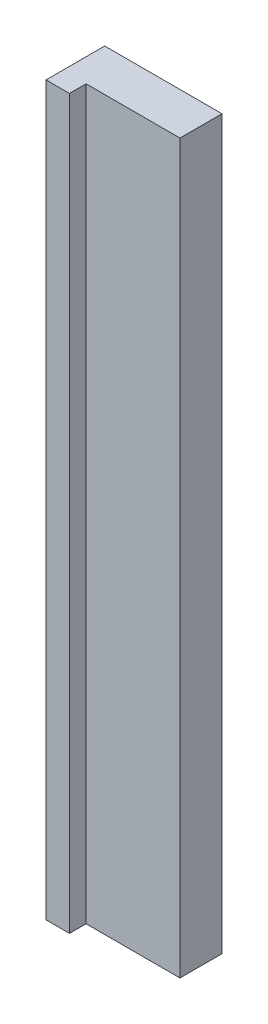
ISO-10303-21;
HEADER;
FILE_DESCRIPTION(('STEP AP214'),'2;1');
FILE_NAME('part.step','',(''),(''),'','','');
FILE_SCHEMA(('AUTOMOTIVE_DESIGN { 1 0 10303 214 1 1 1 1 }'));
ENDSEC;
DATA;
#1=APPLICATION_CONTEXT('core data for automotive mechanical design processes');
#2=APPLICATION_PROTOCOL_DEFINITION('international standard','automotive_design',2000,#1);
#3=PRODUCT_CONTEXT('',#1,'mechanical');
#4=PRODUCT('Part','Part','',(#3));
#5=PRODUCT_RELATED_PRODUCT_CATEGORY('part','',(#4));
#6=PRODUCT_DEFINITION_FORMATION('','',#4);
#7=PRODUCT_DEFINITION_CONTEXT('part definition',#1,'design');
#8=PRODUCT_DEFINITION('design','',#6,#7);
#9=PRODUCT_DEFINITION_SHAPE('','',#8);
#10=(LENGTH_UNIT() NAMED_UNIT(*) SI_UNIT(.MILLI.,.METRE.));
#11=(NAMED_UNIT(*) PLANE_ANGLE_UNIT() SI_UNIT($,.RADIAN.));
#12=(NAMED_UNIT(*) SI_UNIT($,.STERADIAN.) SOLID_ANGLE_UNIT());
#13=UNCERTAINTY_MEASURE_WITH_UNIT(LENGTH_MEASURE(1.E-05),#10,'distance_accuracy_value','');
#14=(GEOMETRIC_REPRESENTATION_CONTEXT(3) GLOBAL_UNCERTAINTY_ASSIGNED_CONTEXT((#13)) GLOBAL_UNIT_ASSIGNED_CONTEXT((#10,
#11,#12)) REPRESENTATION_CONTEXT('',''));
#15=CARTESIAN_POINT('',(0.,0.,0.));
#16=DIRECTION('',(0.,0.,1.));
#17=DIRECTION('',(1.,0.,0.));
#18=AXIS2_PLACEMENT_3D('',#15,#16,#17);
#19=CARTESIAN_POINT('',(82.,-30.,21.5));
#20=DIRECTION('',(0.,0.,-1.));
#21=DIRECTION('',(1.,0.,0.));
#22=AXIS2_PLACEMENT_3D('',#19,#20,#21);
#23=PLANE('',#22);
#24=DIRECTION('',(0.,1.,0.));
#25=VECTOR('',#24,1.);
#26=CARTESIAN_POINT('',(-10.9999999999999,141.,21.5));
#27=LINE('',#26,#25);
#28=CARTESIAN_POINT('',(-10.9999999999999,-231.,21.5));
#29=VERTEX_POINT('',#28);
#30=CARTESIAN_POINT('',(-10.9999999999999,141.,21.5));
#31=VERTEX_POINT('',#30);
#32=EDGE_CURVE('E49',#29,#31,#27,.T.);
#33=ORIENTED_EDGE('',*,*,#32,.F.);
#34=DIRECTION('',(-1.,0.,0.));
#35=VECTOR('',#34,1.);
#36=CARTESIAN_POINT('',(-22.9999999999998,-231.,21.5));
#37=LINE('',#36,#35);
#38=CARTESIAN_POINT('',(37.0000000000001,-231.,21.5));
#39=VERTEX_POINT('',#38);
#40=EDGE_CURVE('E84',#39,#29,#37,.T.);
#41=ORIENTED_EDGE('',*,*,#40,.F.);
#42=DIRECTION('',(0.,1.,0.));
#43=VECTOR('',#42,1.);
#44=CARTESIAN_POINT('',(37.,141.,21.5));
#45=LINE('',#44,#43);
#46=CARTESIAN_POINT('',(37.,141.,21.5));
#47=VERTEX_POINT('',#46);
#48=EDGE_CURVE('E11',#39,#47,#45,.T.);
#49=ORIENTED_EDGE('',*,*,#48,.T.);
#50=DIRECTION('',(-1.,0.,0.));
#51=VECTOR('',#50,1.);
#52=CARTESIAN_POINT('',(-22.9999999999999,141.,21.5));
#53=LINE('',#52,#51);
#54=EDGE_CURVE('E42',#47,#31,#53,.T.);
#55=ORIENTED_EDGE('',*,*,#54,.T.);
#56=EDGE_LOOP('',(#33,#41,#49,#55));
#57=FACE_BOUND('',#56,.T.);
#58=ADVANCED_FACE('F34',(#57),#23,.F.);
#59=CARTESIAN_POINT('',(-23.,141.,398.307643234582));
#60=DIRECTION('',(0.,1.,0.));
#61=DIRECTION('',(0.,0.,1.));
#62=AXIS2_PLACEMENT_3D('',#59,#60,#61);
#63=PLANE('',#62);
#64=ORIENTED_EDGE('',*,*,#54,.F.);
#65=DIRECTION('',(0.,0.,-1.));
#66=VECTOR('',#65,1.);
#67=CARTESIAN_POINT('',(37.,141.,398.307643234582));
#68=LINE('',#67,#66);
#69=CARTESIAN_POINT('',(37.,141.,0.));
#70=VERTEX_POINT('',#69);
#71=EDGE_CURVE('E120',#47,#70,#68,.T.);
#72=ORIENTED_EDGE('',*,*,#71,.T.);
#73=DIRECTION('',(1.,0.,0.));
#74=VECTOR('',#73,1.);
#75=CARTESIAN_POINT('',(-23.,141.,0.));
#76=LINE('',#75,#74);
#77=CARTESIAN_POINT('',(-23.,141.,0.));
#78=VERTEX_POINT('',#77);
#79=EDGE_CURVE('E108',#78,#70,#76,.T.);
#80=ORIENTED_EDGE('',*,*,#79,.F.);
#81=DIRECTION('',(0.,0.,-1.));
#82=VECTOR('',#81,1.);
#83=CARTESIAN_POINT('',(-23.,141.,398.307643234582));
#84=LINE('',#83,#82);
#85=CARTESIAN_POINT('',(-23.,141.,30.));
#86=VERTEX_POINT('',#85);
#87=EDGE_CURVE('E106',#86,#78,#84,.T.);
#88=ORIENTED_EDGE('',*,*,#87,.F.);
#89=DIRECTION('',(1.,0.,0.));
#90=VECTOR('',#89,1.);
#91=CARTESIAN_POINT('',(-22.9999999999999,141.,30.));
#92=LINE('',#91,#90);
#93=CARTESIAN_POINT('',(-10.9999999999999,141.,30.));
#94=VERTEX_POINT('',#93);
#95=EDGE_CURVE('E90',#86,#94,#92,.T.);
#96=ORIENTED_EDGE('',*,*,#95,.T.);
#97=DIRECTION('',(0.,0.,-1.));
#98=VECTOR('',#97,1.);
#99=CARTESIAN_POINT('',(-10.9999999999999,141.,402.1934980625));
#100=LINE('',#99,#98);
#101=EDGE_CURVE('E88',#94,#31,#100,.T.);
#102=ORIENTED_EDGE('',*,*,#101,.T.);
#103=EDGE_LOOP('',(#64,#72,#80,#88,#96,#102));
#104=FACE_BOUND('',#103,.T.);
#105=ADVANCED_FACE('F36',(#104),#63,.T.);
#106=CARTESIAN_POINT('',(-23.,141.,398.307643234582));
#107=DIRECTION('',(1.,0.,0.));
#108=DIRECTION('',(0.,1.,0.));
#109=AXIS2_PLACEMENT_3D('',#106,#107,#108);
#110=PLANE('',#109);
#111=DIRECTION('',(0.,0.,-1.));
#112=VECTOR('',#111,1.);
#113=CARTESIAN_POINT('',(-22.9999999999999,-231.,398.307643234582));
#114=LINE('',#113,#112);
#115=CARTESIAN_POINT('',(-22.9999999999999,-231.,30.));
#116=VERTEX_POINT('',#115);
#117=CARTESIAN_POINT('',(-22.9999999999999,-231.,0.));
#118=VERTEX_POINT('',#117);
#119=EDGE_CURVE('E122',#116,#118,#114,.T.);
#120=ORIENTED_EDGE('',*,*,#119,.F.);
#121=DIRECTION('',(0.,1.,0.));
#122=VECTOR('',#121,1.);
#123=CARTESIAN_POINT('',(-23.,141.,30.));
#124=LINE('',#123,#122);
#125=EDGE_CURVE('E100',#116,#86,#124,.T.);
#126=ORIENTED_EDGE('',*,*,#125,.T.);
#127=ORIENTED_EDGE('',*,*,#87,.T.);
#128=DIRECTION('',(0.,-1.,0.));
#129=VECTOR('',#128,1.);
#130=CARTESIAN_POINT('',(-23.,141.,0.));
#131=LINE('',#130,#129);
#132=EDGE_CURVE('E117',#78,#118,#131,.T.);
#133=ORIENTED_EDGE('',*,*,#132,.T.);
#134=EDGE_LOOP('',(#120,#126,#127,#133));
#135=FACE_BOUND('',#134,.T.);
#136=ADVANCED_FACE('F135',(#135),#110,.F.);
#137=CARTESIAN_POINT('',(-22.9999999999999,-231.,398.307643234582));
#138=DIRECTION('',(0.,1.,0.));
#139=DIRECTION('',(0.,0.,1.));
#140=AXIS2_PLACEMENT_3D('',#137,#138,#139);
#141=PLANE('',#140);
#142=DIRECTION('',(0.,0.,-1.));
#143=VECTOR('',#142,1.);
#144=CARTESIAN_POINT('',(37.0000000000001,-231.,398.307643234582));
#145=LINE('',#144,#143);
#146=CARTESIAN_POINT('',(37.0000000000001,-231.,0.));
#147=VERTEX_POINT('',#146);
#148=EDGE_CURVE('E124',#39,#147,#145,.T.);
#149=ORIENTED_EDGE('',*,*,#148,.F.);
#150=ORIENTED_EDGE('',*,*,#40,.T.);
#151=DIRECTION('',(0.,0.,-1.));
#152=VECTOR('',#151,1.);
#153=CARTESIAN_POINT('',(-10.9999999999999,-231.,402.1934980625));
#154=LINE('',#153,#152);
#155=CARTESIAN_POINT('',(-10.9999999999999,-231.,30.));
#156=VERTEX_POINT('',#155);
#157=EDGE_CURVE('E93',#156,#29,#154,.T.);
#158=ORIENTED_EDGE('',*,*,#157,.F.);
#159=DIRECTION('',(-1.,0.,0.));
#160=VECTOR('',#159,1.);
#161=CARTESIAN_POINT('',(-22.9999999999998,-231.,30.));
#162=LINE('',#161,#160);
#163=EDGE_CURVE('E141',#156,#116,#162,.T.);
#164=ORIENTED_EDGE('',*,*,#163,.T.);
#165=ORIENTED_EDGE('',*,*,#119,.T.);
#166=DIRECTION('',(1.,0.,0.));
#167=VECTOR('',#166,1.);
#168=CARTESIAN_POINT('',(-22.9999999999999,-231.,0.));
#169=LINE('',#168,#167);
#170=EDGE_CURVE('E114',#118,#147,#169,.T.);
#171=ORIENTED_EDGE('',*,*,#170,.T.);
#172=EDGE_LOOP('',(#149,#150,#158,#164,#165,#171));
#173=FACE_BOUND('',#172,.T.);
#174=ADVANCED_FACE('F144',(#173),#141,.F.);
#175=CARTESIAN_POINT('',(37.,141.,398.307643234582));
#176=DIRECTION('',(1.,0.,0.));
#177=DIRECTION('',(0.,1.,0.));
#178=AXIS2_PLACEMENT_3D('',#175,#176,#177);
#179=PLANE('',#178);
#180=ORIENTED_EDGE('',*,*,#48,.F.);
#181=ORIENTED_EDGE('',*,*,#148,.T.);
#182=DIRECTION('',(0.,-1.,0.));
#183=VECTOR('',#182,1.);
#184=CARTESIAN_POINT('',(37.,141.,0.));
#185=LINE('',#184,#183);
#186=EDGE_CURVE('E111',#70,#147,#185,.T.);
#187=ORIENTED_EDGE('',*,*,#186,.F.);
#188=ORIENTED_EDGE('',*,*,#71,.F.);
#189=EDGE_LOOP('',(#180,#181,#187,#188));
#190=FACE_BOUND('',#189,.T.);
#191=ADVANCED_FACE('F128',(#190),#179,.T.);
#192=CARTESIAN_POINT('',(0.,0.,0.));
#193=DIRECTION('',(0.,0.,-1.));
#194=DIRECTION('',(-1.,0.,0.));
#195=AXIS2_PLACEMENT_3D('',#192,#193,#194);
#196=PLANE('',#195);
#197=ORIENTED_EDGE('',*,*,#79,.T.);
#198=ORIENTED_EDGE('',*,*,#186,.T.);
#199=ORIENTED_EDGE('',*,*,#170,.F.);
#200=ORIENTED_EDGE('',*,*,#132,.F.);
#201=EDGE_LOOP('',(#197,#198,#199,#200));
#202=FACE_BOUND('',#201,.T.);
#203=ADVANCED_FACE('F133',(#202),#196,.T.);
#204=CARTESIAN_POINT('',(-10.9999999999999,141.,402.1934980625));
#205=DIRECTION('',(-1.,0.,0.));
#206=DIRECTION('',(0.,-1.,0.));
#207=AXIS2_PLACEMENT_3D('',#204,#205,#206);
#208=PLANE('',#207);
#209=ORIENTED_EDGE('',*,*,#101,.F.);
#210=DIRECTION('',(0.,-1.,0.));
#211=VECTOR('',#210,1.);
#212=CARTESIAN_POINT('',(-10.9999999999999,141.,30.));
#213=LINE('',#212,#211);
#214=EDGE_CURVE('E105',#94,#156,#213,.T.);
#215=ORIENTED_EDGE('',*,*,#214,.T.);
#216=ORIENTED_EDGE('',*,*,#157,.T.);
#217=ORIENTED_EDGE('',*,*,#32,.T.);
#218=EDGE_LOOP('',(#209,#215,#216,#217));
#219=FACE_BOUND('',#218,.T.);
#220=ADVANCED_FACE('F96',(#219),#208,.F.);
#221=CARTESIAN_POINT('',(82.,-30.,30.));
#222=DIRECTION('',(0.,0.,-1.));
#223=DIRECTION('',(1.,0.,0.));
#224=AXIS2_PLACEMENT_3D('',#221,#222,#223);
#225=PLANE('',#224);
#226=ORIENTED_EDGE('',*,*,#163,.F.);
#227=ORIENTED_EDGE('',*,*,#214,.F.);
#228=ORIENTED_EDGE('',*,*,#95,.F.);
#229=ORIENTED_EDGE('',*,*,#125,.F.);
#230=EDGE_LOOP('',(#226,#227,#228,#229));
#231=FACE_BOUND('',#230,.T.);
#232=ADVANCED_FACE('F139',(#231),#225,.F.);
#233=CLOSED_SHELL('',(#58,#105,#136,#174,#191,#203,#220,#232));
#234=MANIFOLD_SOLID_BREP('B2',#233);
#235=ADVANCED_BREP_SHAPE_REPRESENTATION('',(#18,#234),#14);
#236=SHAPE_DEFINITION_REPRESENTATION(#9,#235);
ENDSEC;
END-ISO-10303-21;
